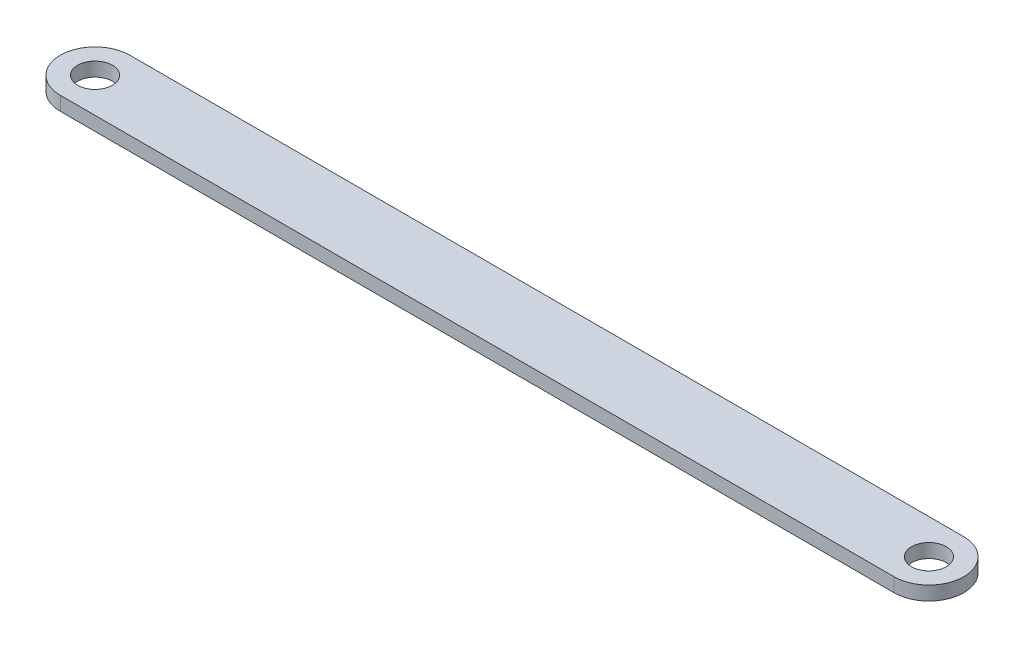
ISO-10303-21;
HEADER;
FILE_DESCRIPTION(('STEP AP214'),'2;1');
FILE_NAME('part.step','',(''),(''),'','','');
FILE_SCHEMA(('AUTOMOTIVE_DESIGN { 1 0 10303 214 1 1 1 1 }'));
ENDSEC;
DATA;
#1=APPLICATION_CONTEXT('core data for automotive mechanical design processes');
#2=APPLICATION_PROTOCOL_DEFINITION('international standard','automotive_design',2000,#1);
#3=PRODUCT_CONTEXT('',#1,'mechanical');
#4=PRODUCT('Part','Part','',(#3));
#5=PRODUCT_RELATED_PRODUCT_CATEGORY('part','',(#4));
#6=PRODUCT_DEFINITION_FORMATION('','',#4);
#7=PRODUCT_DEFINITION_CONTEXT('part definition',#1,'design');
#8=PRODUCT_DEFINITION('design','',#6,#7);
#9=PRODUCT_DEFINITION_SHAPE('','',#8);
#10=(LENGTH_UNIT() NAMED_UNIT(*) SI_UNIT(.MILLI.,.METRE.));
#11=(NAMED_UNIT(*) PLANE_ANGLE_UNIT() SI_UNIT($,.RADIAN.));
#12=(NAMED_UNIT(*) SI_UNIT($,.STERADIAN.) SOLID_ANGLE_UNIT());
#13=UNCERTAINTY_MEASURE_WITH_UNIT(LENGTH_MEASURE(1.E-05),#10,'distance_accuracy_value','');
#14=(GEOMETRIC_REPRESENTATION_CONTEXT(3) GLOBAL_UNCERTAINTY_ASSIGNED_CONTEXT((#13)) GLOBAL_UNIT_ASSIGNED_CONTEXT((#10,
#11,#12)) REPRESENTATION_CONTEXT('',''));
#15=CARTESIAN_POINT('',(0.,0.,0.));
#16=DIRECTION('',(0.,0.,1.));
#17=DIRECTION('',(1.,0.,0.));
#18=AXIS2_PLACEMENT_3D('',#15,#16,#17);
#19=CARTESIAN_POINT('',(-76.2,2.54,0.));
#20=DIRECTION('',(0.,1.,0.));
#21=DIRECTION('',(0.,0.,1.));
#22=AXIS2_PLACEMENT_3D('',#19,#20,#21);
#23=PLANE('',#22);
#24=CARTESIAN_POINT('',(-76.2,2.54,0.));
#25=DIRECTION('',(0.,1.,0.));
#26=DIRECTION('',(0.,0.,1.));
#27=AXIS2_PLACEMENT_3D('',#24,#25,#26);
#28=CIRCLE('',#27,3.175);
#29=CARTESIAN_POINT('',(-76.2,2.54,3.175));
#30=VERTEX_POINT('',#29);
#31=EDGE_CURVE('E116',#30,#30,#28,.T.);
#32=ORIENTED_EDGE('',*,*,#31,.F.);
#33=EDGE_LOOP('',(#32));
#34=FACE_BOUND('',#33,.T.);
#35=CARTESIAN_POINT('',(-76.2,2.54,0.));
#36=DIRECTION('',(0.,1.,0.));
#37=DIRECTION('',(0.,0.,1.));
#38=AXIS2_PLACEMENT_3D('',#35,#36,#37);
#39=CIRCLE('',#38,6.35);
#40=CARTESIAN_POINT('',(-76.2,2.54,-6.35));
#41=VERTEX_POINT('',#40);
#42=CARTESIAN_POINT('',(-76.2,2.54,6.35));
#43=VERTEX_POINT('',#42);
#44=EDGE_CURVE('E96',#41,#43,#39,.T.);
#45=ORIENTED_EDGE('',*,*,#44,.T.);
#46=DIRECTION('',(1.,0.,0.));
#47=VECTOR('',#46,1.);
#48=CARTESIAN_POINT('',(-76.2,2.54,6.35));
#49=LINE('',#48,#47);
#50=CARTESIAN_POINT('',(76.2,2.54,6.35));
#51=VERTEX_POINT('',#50);
#52=EDGE_CURVE('E91',#43,#51,#49,.T.);
#53=ORIENTED_EDGE('',*,*,#52,.T.);
#54=CARTESIAN_POINT('',(76.2,2.54,0.));
#55=DIRECTION('',(0.,1.,0.));
#56=DIRECTION('',(0.,0.,-1.));
#57=AXIS2_PLACEMENT_3D('',#54,#55,#56);
#58=CIRCLE('',#57,6.35);
#59=CARTESIAN_POINT('',(76.2,2.54,-6.35));
#60=VERTEX_POINT('',#59);
#61=EDGE_CURVE('E94',#51,#60,#58,.T.);
#62=ORIENTED_EDGE('',*,*,#61,.T.);
#63=DIRECTION('',(-1.,0.,0.));
#64=VECTOR('',#63,1.);
#65=CARTESIAN_POINT('',(-76.2,2.54,-6.35));
#66=LINE('',#65,#64);
#67=EDGE_CURVE('E61',#60,#41,#66,.T.);
#68=ORIENTED_EDGE('',*,*,#67,.T.);
#69=EDGE_LOOP('',(#45,#53,#62,#68));
#70=FACE_BOUND('',#69,.T.);
#71=CARTESIAN_POINT('',(76.2,2.54,0.));
#72=DIRECTION('',(0.,1.,0.));
#73=DIRECTION('',(0.,0.,-1.));
#74=AXIS2_PLACEMENT_3D('',#71,#72,#73);
#75=CIRCLE('',#74,3.175);
#76=CARTESIAN_POINT('',(76.2,2.54,-3.175));
#77=VERTEX_POINT('',#76);
#78=EDGE_CURVE('E138',#77,#77,#75,.T.);
#79=ORIENTED_EDGE('',*,*,#78,.F.);
#80=EDGE_LOOP('',(#79));
#81=FACE_BOUND('',#80,.T.);
#82=ADVANCED_FACE('F43',(#34,#70,#81),#23,.T.);
#83=CARTESIAN_POINT('',(-76.2,0.,0.));
#84=DIRECTION('',(0.,1.,0.));
#85=DIRECTION('',(0.,0.,1.));
#86=AXIS2_PLACEMENT_3D('',#83,#84,#85);
#87=PLANE('',#86);
#88=CARTESIAN_POINT('',(-76.2,0.,0.));
#89=DIRECTION('',(0.,1.,0.));
#90=DIRECTION('',(0.,0.,1.));
#91=AXIS2_PLACEMENT_3D('',#88,#89,#90);
#92=CIRCLE('',#91,6.35);
#93=CARTESIAN_POINT('',(-76.2,0.,-6.35));
#94=VERTEX_POINT('',#93);
#95=CARTESIAN_POINT('',(-76.2,0.,6.35));
#96=VERTEX_POINT('',#95);
#97=EDGE_CURVE('E112',#94,#96,#92,.T.);
#98=ORIENTED_EDGE('',*,*,#97,.F.);
#99=DIRECTION('',(-1.,0.,0.));
#100=VECTOR('',#99,1.);
#101=CARTESIAN_POINT('',(-76.2,0.,-6.35));
#102=LINE('',#101,#100);
#103=CARTESIAN_POINT('',(76.2,0.,-6.35));
#104=VERTEX_POINT('',#103);
#105=EDGE_CURVE('E84',#104,#94,#102,.T.);
#106=ORIENTED_EDGE('',*,*,#105,.F.);
#107=CARTESIAN_POINT('',(76.2,0.,0.));
#108=DIRECTION('',(0.,1.,0.));
#109=DIRECTION('',(0.,0.,-1.));
#110=AXIS2_PLACEMENT_3D('',#107,#108,#109);
#111=CIRCLE('',#110,6.35);
#112=CARTESIAN_POINT('',(76.2,0.,6.35));
#113=VERTEX_POINT('',#112);
#114=EDGE_CURVE('E78',#113,#104,#111,.T.);
#115=ORIENTED_EDGE('',*,*,#114,.F.);
#116=DIRECTION('',(1.,0.,0.));
#117=VECTOR('',#116,1.);
#118=CARTESIAN_POINT('',(-76.2,0.,6.35));
#119=LINE('',#118,#117);
#120=EDGE_CURVE('E101',#96,#113,#119,.T.);
#121=ORIENTED_EDGE('',*,*,#120,.F.);
#122=EDGE_LOOP('',(#98,#106,#115,#121));
#123=FACE_BOUND('',#122,.T.);
#124=CARTESIAN_POINT('',(-76.2,0.,0.));
#125=DIRECTION('',(0.,1.,0.));
#126=DIRECTION('',(0.,0.,1.));
#127=AXIS2_PLACEMENT_3D('',#124,#125,#126);
#128=CIRCLE('',#127,3.175);
#129=CARTESIAN_POINT('',(-76.2,0.,3.175));
#130=VERTEX_POINT('',#129);
#131=EDGE_CURVE('E134',#130,#130,#128,.T.);
#132=ORIENTED_EDGE('',*,*,#131,.T.);
#133=EDGE_LOOP('',(#132));
#134=FACE_BOUND('',#133,.T.);
#135=CARTESIAN_POINT('',(76.2,0.,0.));
#136=DIRECTION('',(0.,1.,0.));
#137=DIRECTION('',(0.,0.,-1.));
#138=AXIS2_PLACEMENT_3D('',#135,#136,#137);
#139=CIRCLE('',#138,3.175);
#140=CARTESIAN_POINT('',(76.2,0.,-3.175));
#141=VERTEX_POINT('',#140);
#142=EDGE_CURVE('E142',#141,#141,#139,.T.);
#143=ORIENTED_EDGE('',*,*,#142,.T.);
#144=EDGE_LOOP('',(#143));
#145=FACE_BOUND('',#144,.T.);
#146=ADVANCED_FACE('F129',(#123,#134,#145),#87,.F.);
#147=CARTESIAN_POINT('',(-76.2,2.54,0.));
#148=DIRECTION('',(0.,-1.,0.));
#149=DIRECTION('',(0.,0.,-1.));
#150=AXIS2_PLACEMENT_3D('',#147,#148,#149);
#151=CYLINDRICAL_SURFACE('',#150,6.35);
#152=ORIENTED_EDGE('',*,*,#97,.T.);
#153=DIRECTION('',(0.,-1.,0.));
#154=VECTOR('',#153,1.);
#155=CARTESIAN_POINT('',(-76.2,2.54,6.35));
#156=LINE('',#155,#154);
#157=EDGE_CURVE('E11',#43,#96,#156,.T.);
#158=ORIENTED_EDGE('',*,*,#157,.F.);
#159=ORIENTED_EDGE('',*,*,#44,.F.);
#160=DIRECTION('',(0.,-1.,0.));
#161=VECTOR('',#160,1.);
#162=CARTESIAN_POINT('',(-76.2,2.54,-6.35));
#163=LINE('',#162,#161);
#164=EDGE_CURVE('E108',#41,#94,#163,.T.);
#165=ORIENTED_EDGE('',*,*,#164,.T.);
#166=EDGE_LOOP('',(#152,#158,#159,#165));
#167=FACE_BOUND('',#166,.T.);
#168=ADVANCED_FACE('F45',(#167),#151,.T.);
#169=CARTESIAN_POINT('',(-76.2,2.54,6.35));
#170=DIRECTION('',(0.,0.,-1.));
#171=DIRECTION('',(-1.,0.,0.));
#172=AXIS2_PLACEMENT_3D('',#169,#170,#171);
#173=PLANE('',#172);
#174=ORIENTED_EDGE('',*,*,#120,.T.);
#175=DIRECTION('',(0.,-1.,0.));
#176=VECTOR('',#175,1.);
#177=CARTESIAN_POINT('',(76.2,2.54,6.35));
#178=LINE('',#177,#176);
#179=EDGE_CURVE('E53',#51,#113,#178,.T.);
#180=ORIENTED_EDGE('',*,*,#179,.F.);
#181=ORIENTED_EDGE('',*,*,#52,.F.);
#182=ORIENTED_EDGE('',*,*,#157,.T.);
#183=EDGE_LOOP('',(#174,#180,#181,#182));
#184=FACE_BOUND('',#183,.T.);
#185=ADVANCED_FACE('F100',(#184),#173,.F.);
#186=CARTESIAN_POINT('',(76.2,2.54,0.));
#187=DIRECTION('',(0.,-1.,0.));
#188=DIRECTION('',(0.,0.,-1.));
#189=AXIS2_PLACEMENT_3D('',#186,#187,#188);
#190=CYLINDRICAL_SURFACE('',#189,6.35);
#191=ORIENTED_EDGE('',*,*,#114,.T.);
#192=DIRECTION('',(0.,-1.,0.));
#193=VECTOR('',#192,1.);
#194=CARTESIAN_POINT('',(76.2,2.54,-6.35));
#195=LINE('',#194,#193);
#196=EDGE_CURVE('E103',#60,#104,#195,.T.);
#197=ORIENTED_EDGE('',*,*,#196,.F.);
#198=ORIENTED_EDGE('',*,*,#61,.F.);
#199=ORIENTED_EDGE('',*,*,#179,.T.);
#200=EDGE_LOOP('',(#191,#197,#198,#199));
#201=FACE_BOUND('',#200,.T.);
#202=ADVANCED_FACE('F104',(#201),#190,.T.);
#203=CARTESIAN_POINT('',(-76.2,2.54,-6.35));
#204=DIRECTION('',(0.,0.,1.));
#205=DIRECTION('',(1.,0.,0.));
#206=AXIS2_PLACEMENT_3D('',#203,#204,#205);
#207=PLANE('',#206);
#208=ORIENTED_EDGE('',*,*,#105,.T.);
#209=ORIENTED_EDGE('',*,*,#164,.F.);
#210=ORIENTED_EDGE('',*,*,#67,.F.);
#211=ORIENTED_EDGE('',*,*,#196,.T.);
#212=EDGE_LOOP('',(#208,#209,#210,#211));
#213=FACE_BOUND('',#212,.T.);
#214=ADVANCED_FACE('F126',(#213),#207,.F.);
#215=CARTESIAN_POINT('',(-76.2,2.54,0.));
#216=DIRECTION('',(0.,-1.,0.));
#217=DIRECTION('',(0.,0.,-1.));
#218=AXIS2_PLACEMENT_3D('',#215,#216,#217);
#219=CYLINDRICAL_SURFACE('',#218,3.175);
#220=ORIENTED_EDGE('',*,*,#31,.T.);
#221=EDGE_LOOP('',(#220));
#222=FACE_BOUND('',#221,.T.);
#223=ORIENTED_EDGE('',*,*,#131,.F.);
#224=EDGE_LOOP('',(#223));
#225=FACE_BOUND('',#224,.T.);
#226=ADVANCED_FACE('F161',(#222,#225),#219,.F.);
#227=CARTESIAN_POINT('',(76.2,2.54,0.));
#228=DIRECTION('',(0.,-1.,0.));
#229=DIRECTION('',(0.,0.,-1.));
#230=AXIS2_PLACEMENT_3D('',#227,#228,#229);
#231=CYLINDRICAL_SURFACE('',#230,3.175);
#232=ORIENTED_EDGE('',*,*,#78,.T.);
#233=EDGE_LOOP('',(#232));
#234=FACE_BOUND('',#233,.T.);
#235=ORIENTED_EDGE('',*,*,#142,.F.);
#236=EDGE_LOOP('',(#235));
#237=FACE_BOUND('',#236,.T.);
#238=ADVANCED_FACE('F150',(#234,#237),#231,.F.);
#239=CLOSED_SHELL('',(#82,#146,#168,#185,#202,#214,#226,#238));
#240=MANIFOLD_SOLID_BREP('B2',#239);
#241=ADVANCED_BREP_SHAPE_REPRESENTATION('',(#18,#240),#14);
#242=SHAPE_DEFINITION_REPRESENTATION(#9,#241);
ENDSEC;
END-ISO-10303-21;
